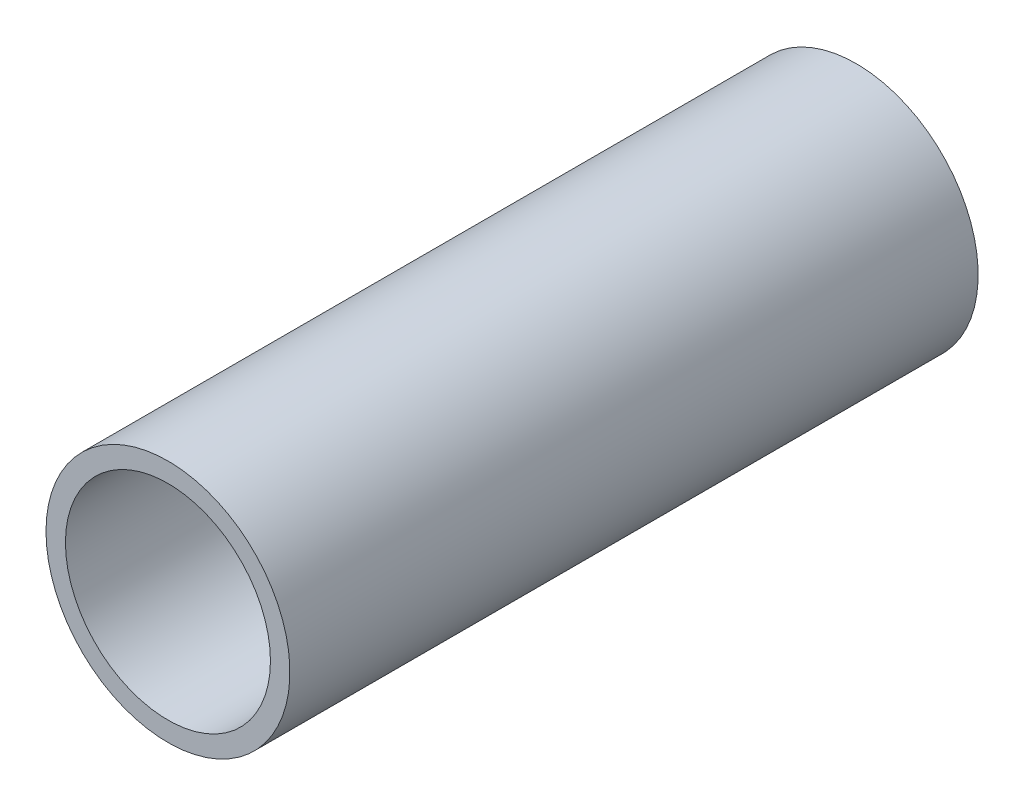
ISO-10303-21;
HEADER;
FILE_DESCRIPTION(('STEP AP214'),'2;1');
FILE_NAME('part.step','',(''),(''),'','','');
FILE_SCHEMA(('AUTOMOTIVE_DESIGN { 1 0 10303 214 1 1 1 1 }'));
ENDSEC;
DATA;
#1=APPLICATION_CONTEXT('core data for automotive mechanical design processes');
#2=APPLICATION_PROTOCOL_DEFINITION('international standard','automotive_design',2000,#1);
#3=PRODUCT_CONTEXT('',#1,'mechanical');
#4=PRODUCT('Part','Part','',(#3));
#5=PRODUCT_RELATED_PRODUCT_CATEGORY('part','',(#4));
#6=PRODUCT_DEFINITION_FORMATION('','',#4);
#7=PRODUCT_DEFINITION_CONTEXT('part definition',#1,'design');
#8=PRODUCT_DEFINITION('design','',#6,#7);
#9=PRODUCT_DEFINITION_SHAPE('','',#8);
#10=(LENGTH_UNIT() NAMED_UNIT(*) SI_UNIT(.MILLI.,.METRE.));
#11=(NAMED_UNIT(*) PLANE_ANGLE_UNIT() SI_UNIT($,.RADIAN.));
#12=(NAMED_UNIT(*) SI_UNIT($,.STERADIAN.) SOLID_ANGLE_UNIT());
#13=UNCERTAINTY_MEASURE_WITH_UNIT(LENGTH_MEASURE(1.E-05),#10,'distance_accuracy_value','');
#14=(GEOMETRIC_REPRESENTATION_CONTEXT(3) GLOBAL_UNCERTAINTY_ASSIGNED_CONTEXT((#13)) GLOBAL_UNIT_ASSIGNED_CONTEXT((#10,
#11,#12)) REPRESENTATION_CONTEXT('',''));
#15=CARTESIAN_POINT('',(0.,0.,0.));
#16=DIRECTION('',(0.,0.,1.));
#17=DIRECTION('',(1.,0.,0.));
#18=AXIS2_PLACEMENT_3D('',#15,#16,#17);
#19=CARTESIAN_POINT('',(0.,0.,26.9875));
#20=DIRECTION('',(0.,0.,-1.));
#21=DIRECTION('',(-1.,0.,0.));
#22=AXIS2_PLACEMENT_3D('',#19,#20,#21);
#23=CYLINDRICAL_SURFACE('',#22,8.0391);
#24=CARTESIAN_POINT('',(0.,0.,-26.9875));
#25=DIRECTION('',(0.,0.,-1.));
#26=DIRECTION('',(-1.,0.,0.));
#27=AXIS2_PLACEMENT_3D('',#24,#25,#26);
#28=CIRCLE('',#27,8.0391);
#29=CARTESIAN_POINT('',(-8.0391,0.,-26.9875));
#30=VERTEX_POINT('',#29);
#31=EDGE_CURVE('E27',#30,#30,#28,.T.);
#32=ORIENTED_EDGE('',*,*,#31,.T.);
#33=EDGE_LOOP('',(#32));
#34=FACE_BOUND('',#33,.T.);
#35=CARTESIAN_POINT('',(0.,0.,26.9875));
#36=DIRECTION('',(0.,0.,-1.));
#37=DIRECTION('',(-1.,0.,0.));
#38=AXIS2_PLACEMENT_3D('',#35,#36,#37);
#39=CIRCLE('',#38,8.0391);
#40=CARTESIAN_POINT('',(-8.0391,0.,26.9875));
#41=VERTEX_POINT('',#40);
#42=EDGE_CURVE('E18',#41,#41,#39,.T.);
#43=ORIENTED_EDGE('',*,*,#42,.F.);
#44=EDGE_LOOP('',(#43));
#45=FACE_BOUND('',#44,.T.);
#46=ADVANCED_FACE('F15',(#34,#45),#23,.F.);
#47=CARTESIAN_POINT('',(0.,0.,26.9875));
#48=DIRECTION('',(0.,0.,1.));
#49=DIRECTION('',(1.,0.,0.));
#50=AXIS2_PLACEMENT_3D('',#47,#48,#49);
#51=PLANE('',#50);
#52=ORIENTED_EDGE('',*,*,#42,.T.);
#53=EDGE_LOOP('',(#52));
#54=FACE_BOUND('',#53,.T.);
#55=CARTESIAN_POINT('',(0.,0.,26.9875));
#56=DIRECTION('',(0.,0.,-1.));
#57=DIRECTION('',(-1.,0.,0.));
#58=AXIS2_PLACEMENT_3D('',#55,#56,#57);
#59=CIRCLE('',#58,9.5631);
#60=CARTESIAN_POINT('',(-9.5631,0.,26.9875));
#61=VERTEX_POINT('',#60);
#62=EDGE_CURVE('E22',#61,#61,#59,.T.);
#63=ORIENTED_EDGE('',*,*,#62,.F.);
#64=EDGE_LOOP('',(#63));
#65=FACE_BOUND('',#64,.T.);
#66=ADVANCED_FACE('F35',(#54,#65),#51,.T.);
#67=CARTESIAN_POINT('',(0.,0.,-26.9875));
#68=DIRECTION('',(0.,0.,1.));
#69=DIRECTION('',(1.,0.,0.));
#70=AXIS2_PLACEMENT_3D('',#67,#68,#69);
#71=PLANE('',#70);
#72=ORIENTED_EDGE('',*,*,#31,.F.);
#73=EDGE_LOOP('',(#72));
#74=FACE_BOUND('',#73,.T.);
#75=CARTESIAN_POINT('',(0.,0.,-26.9875));
#76=DIRECTION('',(0.,0.,-1.));
#77=DIRECTION('',(-1.,0.,0.));
#78=AXIS2_PLACEMENT_3D('',#75,#76,#77);
#79=CIRCLE('',#78,9.5631);
#80=CARTESIAN_POINT('',(-9.5631,0.,-26.9875));
#81=VERTEX_POINT('',#80);
#82=EDGE_CURVE('E10',#81,#81,#79,.F.);
#83=ORIENTED_EDGE('',*,*,#82,.F.);
#84=EDGE_LOOP('',(#83));
#85=FACE_BOUND('',#84,.T.);
#86=ADVANCED_FACE('F43',(#74,#85),#71,.F.);
#87=CARTESIAN_POINT('',(0.,0.,26.9875));
#88=DIRECTION('',(0.,0.,-1.));
#89=DIRECTION('',(-1.,0.,0.));
#90=AXIS2_PLACEMENT_3D('',#87,#88,#89);
#91=CYLINDRICAL_SURFACE('',#90,9.5631);
#92=ORIENTED_EDGE('',*,*,#82,.T.);
#93=EDGE_LOOP('',(#92));
#94=FACE_BOUND('',#93,.T.);
#95=ORIENTED_EDGE('',*,*,#62,.T.);
#96=EDGE_LOOP('',(#95));
#97=FACE_BOUND('',#96,.T.);
#98=ADVANCED_FACE('F44',(#94,#97),#91,.T.);
#99=CLOSED_SHELL('',(#46,#66,#86,#98));
#100=MANIFOLD_SOLID_BREP('B1',#99);
#101=ADVANCED_BREP_SHAPE_REPRESENTATION('',(#18,#100),#14);
#102=SHAPE_DEFINITION_REPRESENTATION(#9,#101);
ENDSEC;
END-ISO-10303-21;
